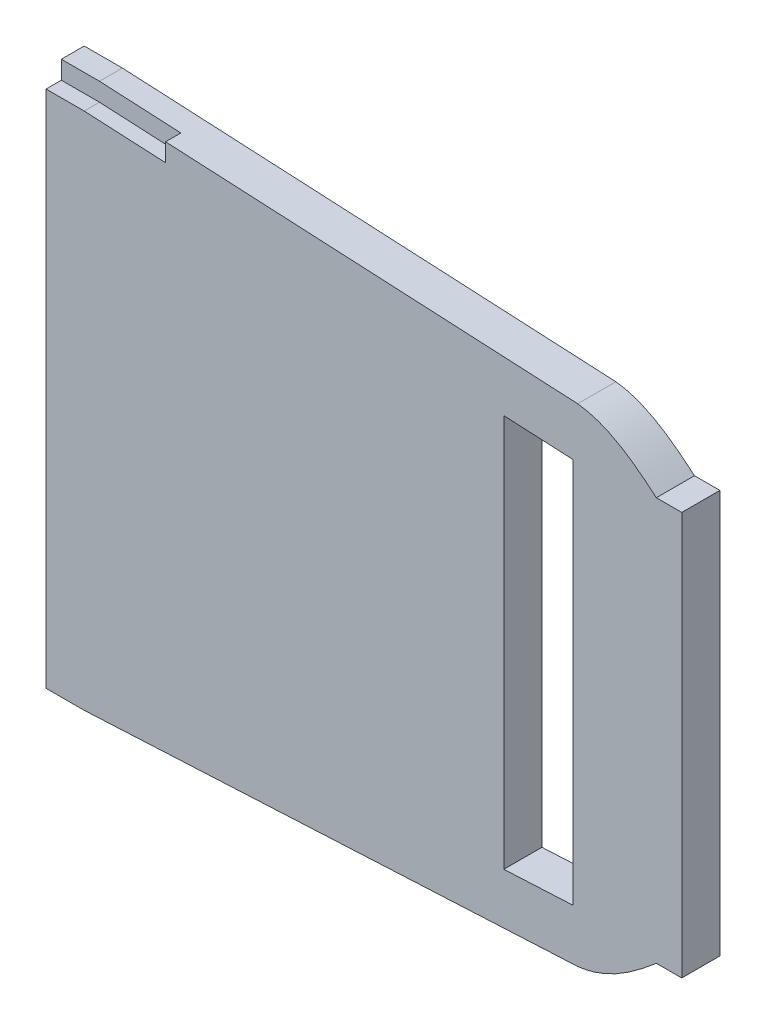
ISO-10303-21;
HEADER;
FILE_DESCRIPTION(('STEP AP214'),'2;1');
FILE_NAME('part.step','',(''),(''),'','','');
FILE_SCHEMA(('AUTOMOTIVE_DESIGN { 1 0 10303 214 1 1 1 1 }'));
ENDSEC;
DATA;
#1=APPLICATION_CONTEXT('core data for automotive mechanical design processes');
#2=APPLICATION_PROTOCOL_DEFINITION('international standard','automotive_design',2000,#1);
#3=PRODUCT_CONTEXT('',#1,'mechanical');
#4=PRODUCT('Part','Part','',(#3));
#5=PRODUCT_RELATED_PRODUCT_CATEGORY('part','',(#4));
#6=PRODUCT_DEFINITION_FORMATION('','',#4);
#7=PRODUCT_DEFINITION_CONTEXT('part definition',#1,'design');
#8=PRODUCT_DEFINITION('design','',#6,#7);
#9=PRODUCT_DEFINITION_SHAPE('','',#8);
#10=(LENGTH_UNIT() NAMED_UNIT(*) SI_UNIT(.MILLI.,.METRE.));
#11=(NAMED_UNIT(*) PLANE_ANGLE_UNIT() SI_UNIT($,.RADIAN.));
#12=(NAMED_UNIT(*) SI_UNIT($,.STERADIAN.) SOLID_ANGLE_UNIT());
#13=UNCERTAINTY_MEASURE_WITH_UNIT(LENGTH_MEASURE(1.E-05),#10,'distance_accuracy_value','');
#14=(GEOMETRIC_REPRESENTATION_CONTEXT(3) GLOBAL_UNCERTAINTY_ASSIGNED_CONTEXT((#13)) GLOBAL_UNIT_ASSIGNED_CONTEXT((#10,
#11,#12)) REPRESENTATION_CONTEXT('',''));
#15=CARTESIAN_POINT('',(0.,0.,0.));
#16=DIRECTION('',(0.,0.,1.));
#17=DIRECTION('',(1.,0.,0.));
#18=AXIS2_PLACEMENT_3D('',#15,#16,#17);
#19=CARTESIAN_POINT('',(113.496599029242,-53.9274721495546,7.5));
#20=CARTESIAN_POINT('',(114.973875685019,-53.7603476797445,7.5));
#21=CARTESIAN_POINT('',(116.389465073367,-53.4083030879014,7.5));
#22=CARTESIAN_POINT('',(118.438931287648,-52.6586523663147,7.5));
#23=CARTESIAN_POINT('',(119.109837198218,-52.372048443912,7.5));
#24=CARTESIAN_POINT('',(120.430638867593,-51.7358583988843,7.5));
#25=CARTESIAN_POINT('',(121.08291585581,-51.3847824339607,7.5));
#26=CARTESIAN_POINT('',(122.988929435586,-50.2674897114088,7.5));
#27=CARTESIAN_POINT('',(124.197203446337,-49.4371699813625,7.5));
#28=CARTESIAN_POINT('',(126.541735841739,-47.677906535742,7.5));
#29=CARTESIAN_POINT('',(127.677620036209,-46.7484503740677,7.5));
#30=CARTESIAN_POINT('',(128.850515141027,-45.748918780121,7.5));
#31=CARTESIAN_POINT('',(128.904828159406,-45.7025433508818,7.5));
#32=CARTESIAN_POINT('',(128.959100065767,-45.6561164922051,7.5));
#33=B_SPLINE_CURVE_WITH_KNOTS('',3,(#19,#20,#21,#22,#23,#24,#25,#26,#27,#28,#29,#30,#31,#32),
.UNSPECIFIED.,.F.,.F.,(4,2,2,2,2,2,4),(0.,0.125,0.1875,0.25,0.375,0.5,0.506074437752963),.UNSPECIFIED.);
#34=DIRECTION('',(0.,0.,-1.));
#35=VECTOR('',#34,1.);
#36=SURFACE_OF_LINEAR_EXTRUSION('',#33,#35);
#37=CARTESIAN_POINT('',(113.496599029242,-53.9274721495546,0.));
#38=CARTESIAN_POINT('',(114.973875685019,-53.7603476797445,0.));
#39=CARTESIAN_POINT('',(116.389465073367,-53.4083030879014,0.));
#40=CARTESIAN_POINT('',(118.438931287648,-52.6586523663147,0.));
#41=CARTESIAN_POINT('',(119.109837198218,-52.372048443912,0.));
#42=CARTESIAN_POINT('',(120.430638867593,-51.7358583988843,0.));
#43=CARTESIAN_POINT('',(121.08291585581,-51.3847824339607,0.));
#44=CARTESIAN_POINT('',(122.988929435586,-50.2674897114088,0.));
#45=CARTESIAN_POINT('',(124.197203446337,-49.4371699813625,0.));
#46=CARTESIAN_POINT('',(126.541735841739,-47.677906535742,0.));
#47=CARTESIAN_POINT('',(127.677620036209,-46.7484503740677,0.));
#48=CARTESIAN_POINT('',(128.850515141027,-45.748918780121,0.));
#49=CARTESIAN_POINT('',(128.904828159406,-45.7025433508818,0.));
#50=CARTESIAN_POINT('',(128.959100065767,-45.6561164922051,0.));
#51=B_SPLINE_CURVE_WITH_KNOTS('',3,(#37,#38,#39,#40,#41,#42,#43,#44,#45,#46,#47,#48,#49,#50),
.UNSPECIFIED.,.F.,.F.,(4,2,2,2,2,2,4),(0.,0.125,0.1875,0.25,0.375,0.5,0.506074437752963),.UNSPECIFIED.);
#52=CARTESIAN_POINT('',(113.496599029242,-53.9274721495546,0.));
#53=VERTEX_POINT('',#52);
#54=CARTESIAN_POINT('',(128.959100065767,-45.6561164922051,0.));
#55=VERTEX_POINT('',#54);
#56=EDGE_CURVE('E216',#53,#55,#51,.T.);
#57=ORIENTED_EDGE('',*,*,#56,.T.);
#58=DIRECTION('',(0.,0.,-1.));
#59=VECTOR('',#58,1.);
#60=CARTESIAN_POINT('',(128.959100065767,-45.6561164922051,7.5));
#61=LINE('',#60,#59);
#62=CARTESIAN_POINT('',(128.959100065767,-45.6561164922051,7.5));
#63=VERTEX_POINT('',#62);
#64=EDGE_CURVE('E225',#63,#55,#61,.T.);
#65=ORIENTED_EDGE('',*,*,#64,.F.);
#66=CARTESIAN_POINT('',(128.959100065767,-45.6561164922051,7.5));
#67=CARTESIAN_POINT('',(128.904828159406,-45.7025433508818,7.5));
#68=CARTESIAN_POINT('',(128.850515141027,-45.748918780121,7.5));
#69=CARTESIAN_POINT('',(127.677620036209,-46.7484503740677,7.5));
#70=CARTESIAN_POINT('',(126.541735841739,-47.677906535742,7.5));
#71=CARTESIAN_POINT('',(124.197203446337,-49.4371699813625,7.5));
#72=CARTESIAN_POINT('',(122.988929435586,-50.2674897114088,7.5));
#73=CARTESIAN_POINT('',(121.08291585581,-51.3847824339607,7.5));
#74=CARTESIAN_POINT('',(120.430638867593,-51.7358583988843,7.5));
#75=CARTESIAN_POINT('',(119.109837198218,-52.372048443912,7.5));
#76=CARTESIAN_POINT('',(118.438931287648,-52.6586523663147,7.5));
#77=CARTESIAN_POINT('',(116.389465073367,-53.4083030879014,7.5));
#78=CARTESIAN_POINT('',(114.973875685019,-53.7603476797445,7.5));
#79=CARTESIAN_POINT('',(113.496599029242,-53.9274721495546,7.5));
#80=B_SPLINE_CURVE_WITH_KNOTS('',3,(#66,#67,#68,#69,#70,#71,#72,#73,#74,#75,#76,#77,#78,#79),
.UNSPECIFIED.,.F.,.F.,(4,2,2,2,2,2,4),(0.,0.00607443775296213,0.131074437752962,
0.256074437752962,0.318574437752962,0.381074437752962,0.506074437752963),.UNSPECIFIED.);
#81=CARTESIAN_POINT('',(113.496599029242,-53.9274721495546,7.5));
#82=VERTEX_POINT('',#81);
#83=EDGE_CURVE('E222',#82,#63,#80,.F.);
#84=ORIENTED_EDGE('',*,*,#83,.F.);
#85=DIRECTION('',(0.,0.,-1.));
#86=VECTOR('',#85,1.);
#87=CARTESIAN_POINT('',(113.496599029242,-53.9274721495546,7.5));
#88=LINE('',#87,#86);
#89=EDGE_CURVE('E228',#82,#53,#88,.T.);
#90=ORIENTED_EDGE('',*,*,#89,.T.);
#91=EDGE_LOOP('',(#57,#65,#84,#90));
#92=FACE_BOUND('',#91,.T.);
#93=ADVANCED_FACE('F36',(#92),#36,.F.);
#94=CARTESIAN_POINT('',(133.959100065767,-45.6561164922051,7.5));
#95=DIRECTION('',(0.,1.,0.));
#96=DIRECTION('',(0.,0.,1.));
#97=AXIS2_PLACEMENT_3D('',#94,#95,#96);
#98=PLANE('',#97);
#99=DIRECTION('',(1.,0.,0.));
#100=VECTOR('',#99,1.);
#101=CARTESIAN_POINT('',(133.959100065767,-45.6561164922051,0.));
#102=LINE('',#101,#100);
#103=CARTESIAN_POINT('',(133.959100065767,-45.6561164922051,0.));
#104=VERTEX_POINT('',#103);
#105=EDGE_CURVE('E250',#55,#104,#102,.T.);
#106=ORIENTED_EDGE('',*,*,#105,.T.);
#107=DIRECTION('',(0.,0.,-1.));
#108=VECTOR('',#107,1.);
#109=CARTESIAN_POINT('',(133.959100065767,-45.6561164922051,7.5));
#110=LINE('',#109,#108);
#111=CARTESIAN_POINT('',(133.959100065767,-45.6561164922051,7.5));
#112=VERTEX_POINT('',#111);
#113=EDGE_CURVE('E227',#112,#104,#110,.T.);
#114=ORIENTED_EDGE('',*,*,#113,.F.);
#115=DIRECTION('',(1.,0.,0.));
#116=VECTOR('',#115,1.);
#117=CARTESIAN_POINT('',(133.959100065767,-45.6561164922051,7.5));
#118=LINE('',#117,#116);
#119=EDGE_CURVE('E174',#63,#112,#118,.T.);
#120=ORIENTED_EDGE('',*,*,#119,.F.);
#121=ORIENTED_EDGE('',*,*,#64,.T.);
#122=EDGE_LOOP('',(#106,#114,#120,#121));
#123=FACE_BOUND('',#122,.T.);
#124=ADVANCED_FACE('F189',(#123),#98,.F.);
#125=CARTESIAN_POINT('',(133.959100065767,33.6286249988365,7.5));
#126=DIRECTION('',(-1.,0.,0.));
#127=DIRECTION('',(0.,0.,1.));
#128=AXIS2_PLACEMENT_3D('',#125,#126,#127);
#129=PLANE('',#128);
#130=DIRECTION('',(0.,1.,0.));
#131=VECTOR('',#130,1.);
#132=CARTESIAN_POINT('',(133.959100065767,33.6286249988365,0.));
#133=LINE('',#132,#131);
#134=CARTESIAN_POINT('',(133.959100065767,33.6286249988365,0.));
#135=VERTEX_POINT('',#134);
#136=EDGE_CURVE('E167',#104,#135,#133,.T.);
#137=ORIENTED_EDGE('',*,*,#136,.T.);
#138=DIRECTION('',(0.,0.,-1.));
#139=VECTOR('',#138,1.);
#140=CARTESIAN_POINT('',(133.959100065767,33.6286249988365,7.5));
#141=LINE('',#140,#139);
#142=CARTESIAN_POINT('',(133.959100065767,33.6286249988365,7.5));
#143=VERTEX_POINT('',#142);
#144=EDGE_CURVE('E131',#143,#135,#141,.T.);
#145=ORIENTED_EDGE('',*,*,#144,.F.);
#146=DIRECTION('',(0.,1.,0.));
#147=VECTOR('',#146,1.);
#148=CARTESIAN_POINT('',(133.959100065767,33.6286249988365,7.5));
#149=LINE('',#148,#147);
#150=EDGE_CURVE('E137',#112,#143,#149,.T.);
#151=ORIENTED_EDGE('',*,*,#150,.F.);
#152=ORIENTED_EDGE('',*,*,#113,.T.);
#153=EDGE_LOOP('',(#137,#145,#151,#152));
#154=FACE_BOUND('',#153,.T.);
#155=ADVANCED_FACE('F396',(#154),#129,.F.);
#156=CARTESIAN_POINT('',(128.959100065767,33.6286249988365,7.5));
#157=DIRECTION('',(0.,-1.,0.));
#158=DIRECTION('',(1.,0.,0.));
#159=AXIS2_PLACEMENT_3D('',#156,#157,#158);
#160=PLANE('',#159);
#161=DIRECTION('',(-1.,0.,0.));
#162=VECTOR('',#161,1.);
#163=CARTESIAN_POINT('',(128.959100065767,33.6286249988365,0.));
#164=LINE('',#163,#162);
#165=CARTESIAN_POINT('',(128.959100065767,33.6286249988365,0.));
#166=VERTEX_POINT('',#165);
#167=EDGE_CURVE('E273',#135,#166,#164,.T.);
#168=ORIENTED_EDGE('',*,*,#167,.T.);
#169=DIRECTION('',(0.,0.,-1.));
#170=VECTOR('',#169,1.);
#171=CARTESIAN_POINT('',(128.959100065767,33.6286249988365,7.5));
#172=LINE('',#171,#170);
#173=CARTESIAN_POINT('',(128.959100065767,33.6286249988365,7.5));
#174=VERTEX_POINT('',#173);
#175=EDGE_CURVE('E126',#174,#166,#172,.T.);
#176=ORIENTED_EDGE('',*,*,#175,.F.);
#177=DIRECTION('',(-1.,0.,0.));
#178=VECTOR('',#177,1.);
#179=CARTESIAN_POINT('',(128.959100065767,33.6286249988365,7.5));
#180=LINE('',#179,#178);
#181=EDGE_CURVE('E134',#143,#174,#180,.T.);
#182=ORIENTED_EDGE('',*,*,#181,.F.);
#183=ORIENTED_EDGE('',*,*,#144,.T.);
#184=EDGE_LOOP('',(#168,#176,#182,#183));
#185=FACE_BOUND('',#184,.T.);
#186=ADVANCED_FACE('F156',(#185),#160,.F.);
#187=CARTESIAN_POINT('',(128.959100065767,33.6286249988365,7.5));
#188=CARTESIAN_POINT('',(128.913387153807,33.6677305854445,7.5));
#189=CARTESIAN_POINT('',(127.751192536381,34.6603867776478,7.5));
#190=CARTESIAN_POINT('',(126.568806099182,35.6290410882219,7.5));
#191=CARTESIAN_POINT('',(124.805320753888,36.953884088555,7.5));
#192=CARTESIAN_POINT('',(124.207009004084,37.3837862099245,7.5));
#193=CARTESIAN_POINT('',(122.99205254347,38.2061450456974,7.5));
#194=CARTESIAN_POINT('',(122.374602127533,38.5992515888815,7.5));
#195=CARTESIAN_POINT('',(120.48433317173,39.7098518813711,7.5));
#196=CARTESIAN_POINT('',(119.174169326343,40.3596636748386,7.5));
#197=CARTESIAN_POINT('',(117.093195418547,41.1246439768413,7.5));
#198=CARTESIAN_POINT('',(116.387101293958,41.3414820254252,7.5));
#199=CARTESIAN_POINT('',(114.957490186829,41.6872639254354,7.5));
#200=CARTESIAN_POINT('',(114.232477088293,41.816732683296,7.5));
#201=CARTESIAN_POINT('',(113.496599029254,41.8999826486839,7.5));
#202=B_SPLINE_CURVE_WITH_KNOTS('',3,(#187,#188,#189,#190,#191,#192,#193,#194,#195,#196,#197,
#198,#199,#200,#201),.UNSPECIFIED.,.F.,.F.,(4,1,2,2,2,2,2,4),(0.494878568915185,
0.500000000000001,0.625000000000001,0.6875,0.75,0.875,0.9375,1.),.UNSPECIFIED.);
#203=DIRECTION('',(0.,0.,-1.));
#204=VECTOR('',#203,1.);
#205=SURFACE_OF_LINEAR_EXTRUSION('',#202,#204);
#206=CARTESIAN_POINT('',(128.959100065767,33.6286249988365,0.));
#207=CARTESIAN_POINT('',(128.913387153807,33.6677305854445,0.));
#208=CARTESIAN_POINT('',(127.751192536381,34.6603867776478,0.));
#209=CARTESIAN_POINT('',(126.568806099182,35.6290410882219,0.));
#210=CARTESIAN_POINT('',(124.805320753888,36.953884088555,0.));
#211=CARTESIAN_POINT('',(124.207009004084,37.3837862099245,0.));
#212=CARTESIAN_POINT('',(122.99205254347,38.2061450456974,0.));
#213=CARTESIAN_POINT('',(122.374602127533,38.5992515888815,0.));
#214=CARTESIAN_POINT('',(120.48433317173,39.7098518813711,0.));
#215=CARTESIAN_POINT('',(119.174169326343,40.3596636748386,0.));
#216=CARTESIAN_POINT('',(117.093195418547,41.1246439768413,0.));
#217=CARTESIAN_POINT('',(116.387101293958,41.3414820254252,0.));
#218=CARTESIAN_POINT('',(114.957490186829,41.6872639254354,0.));
#219=CARTESIAN_POINT('',(114.232477088293,41.816732683296,0.));
#220=CARTESIAN_POINT('',(113.496599029254,41.8999826486839,0.));
#221=B_SPLINE_CURVE_WITH_KNOTS('',3,(#206,#207,#208,#209,#210,#211,#212,#213,#214,#215,#216,
#217,#218,#219,#220),.UNSPECIFIED.,.F.,.F.,(4,1,2,2,2,2,2,4),(0.494878568915185,
0.500000000000001,0.625000000000001,0.6875,0.75,0.875,0.9375,1.),.UNSPECIFIED.);
#222=CARTESIAN_POINT('',(113.496599029254,41.8999826486839,0.));
#223=VERTEX_POINT('',#222);
#224=EDGE_CURVE('E285',#166,#223,#221,.T.);
#225=ORIENTED_EDGE('',*,*,#224,.T.);
#226=DIRECTION('',(0.,0.,-1.));
#227=VECTOR('',#226,1.);
#228=CARTESIAN_POINT('',(113.496599029254,41.8999826486839,7.5));
#229=LINE('',#228,#227);
#230=CARTESIAN_POINT('',(113.496599029254,41.8999826486839,7.5));
#231=VERTEX_POINT('',#230);
#232=EDGE_CURVE('E119',#231,#223,#229,.T.);
#233=ORIENTED_EDGE('',*,*,#232,.F.);
#234=CARTESIAN_POINT('',(113.496599029254,41.8999826486839,7.5));
#235=CARTESIAN_POINT('',(114.232477088293,41.816732683296,7.5));
#236=CARTESIAN_POINT('',(114.957490186829,41.6872639254354,7.5));
#237=CARTESIAN_POINT('',(116.387101293958,41.3414820254252,7.5));
#238=CARTESIAN_POINT('',(117.093195418547,41.1246439768413,7.5));
#239=CARTESIAN_POINT('',(119.174169326343,40.3596636748386,7.5));
#240=CARTESIAN_POINT('',(120.48433317173,39.7098518813711,7.5));
#241=CARTESIAN_POINT('',(122.374602127533,38.5992515888815,7.5));
#242=CARTESIAN_POINT('',(122.99205254347,38.2061450456974,7.5));
#243=CARTESIAN_POINT('',(124.207009004084,37.3837862099245,7.5));
#244=CARTESIAN_POINT('',(124.805320753888,36.953884088555,7.5));
#245=CARTESIAN_POINT('',(126.568806099182,35.6290410882219,7.5));
#246=CARTESIAN_POINT('',(127.751192536381,34.6603867776478,7.5));
#247=CARTESIAN_POINT('',(128.913387153807,33.6677305854445,7.5));
#248=CARTESIAN_POINT('',(128.959100065767,33.6286249988365,7.5));
#249=B_SPLINE_CURVE_WITH_KNOTS('',3,(#234,#235,#236,#237,#238,#239,#240,#241,#242,#243,#244,
#245,#246,#247,#248),.UNSPECIFIED.,.F.,.F.,(4,2,2,2,2,2,1,4),(0.494878568915185,
0.557378568915185,0.619878568915185,0.744878568915184,0.807378568915184,0.869878568915184,
0.994878568915184,1.),.UNSPECIFIED.);
#250=EDGE_CURVE('E118',#174,#231,#249,.F.);
#251=ORIENTED_EDGE('',*,*,#250,.F.);
#252=ORIENTED_EDGE('',*,*,#175,.T.);
#253=EDGE_LOOP('',(#225,#233,#251,#252));
#254=FACE_BOUND('',#253,.T.);
#255=ADVANCED_FACE('F144',(#254),#205,.F.);
#256=CARTESIAN_POINT('',(-87.7868041786044,42.6350691720137,7.5));
#257=DIRECTION('',(0.,0.,-1.));
#258=DIRECTION('',(-1.,0.,0.));
#259=AXIS2_PLACEMENT_3D('',#256,#257,#258);
#260=PLANE('',#259);
#261=DIRECTION('',(0.,-1.,0.));
#262=VECTOR('',#261,1.);
#263=CARTESIAN_POINT('',(98.9591000657665,32.6219937575387,7.5));
#264=LINE('',#263,#262);
#265=CARTESIAN_POINT('',(98.9591000657665,32.6219937575387,7.5));
#266=VERTEX_POINT('',#265);
#267=CARTESIAN_POINT('',(98.9591000657665,-44.6494832584097,7.5));
#268=VERTEX_POINT('',#267);
#269=EDGE_CURVE('E360',#266,#268,#264,.T.);
#270=ORIENTED_EDGE('',*,*,#269,.F.);
#271=DIRECTION('',(-0.998725119042124,0.0504790708541182,0.));
#272=VECTOR('',#271,1.);
#273=CARTESIAN_POINT('',(112.616329260754,31.9317094870621,7.5));
#274=LINE('',#273,#272);
#275=CARTESIAN_POINT('',(112.616329260754,31.9317094870621,7.5));
#276=VERTEX_POINT('',#275);
#277=EDGE_CURVE('E365',#276,#266,#274,.T.);
#278=ORIENTED_EDGE('',*,*,#277,.F.);
#279=DIRECTION('',(4.17239632132886E-06,0.999999999991296,0.));
#280=VECTOR('',#279,1.);
#281=CARTESIAN_POINT('',(112.616329260754,31.9317094870621,7.5));
#282=LINE('',#281,#280);
#283=CARTESIAN_POINT('',(112.61601261374,-43.959214992383,7.5));
#284=VERTEX_POINT('',#283);
#285=EDGE_CURVE('E368',#284,#276,#282,.T.);
#286=ORIENTED_EDGE('',*,*,#285,.F.);
#287=DIRECTION('',(0.998725119042121,0.0504790708541747,0.));
#288=VECTOR('',#287,1.);
#289=CARTESIAN_POINT('',(98.9591000657665,-44.6494832584097,7.5));
#290=LINE('',#289,#288);
#291=EDGE_CURVE('E354',#268,#284,#290,.T.);
#292=ORIENTED_EDGE('',*,*,#291,.F.);
#293=EDGE_LOOP('',(#270,#278,#286,#292));
#294=FACE_BOUND('',#293,.T.);
#295=DIRECTION('',(0.998725119042124,-0.0504790708541182,0.));
#296=VECTOR('',#295,1.);
#297=CARTESIAN_POINT('',(0.459100065754559,44.0380832453436,7.5));
#298=LINE('',#297,#296);
#299=CARTESIAN_POINT('',(16.4591000657546,43.2293871203873,7.5));
#300=VERTEX_POINT('',#299);
#301=CARTESIAN_POINT('',(32.4591000657546,42.420690995431,7.5));
#302=VERTEX_POINT('',#301);
#303=EDGE_CURVE('E11',#300,#302,#298,.T.);
#304=ORIENTED_EDGE('',*,*,#303,.F.);
#305=DIRECTION('',(1.,0.,0.));
#306=VECTOR('',#305,1.);
#307=CARTESIAN_POINT('',(8.95910006575456,43.2293871203873,7.5));
#308=LINE('',#307,#306);
#309=CARTESIAN_POINT('',(8.95910006575456,43.2293871203873,7.5));
#310=VERTEX_POINT('',#309);
#311=EDGE_CURVE('E511',#310,#300,#308,.T.);
#312=ORIENTED_EDGE('',*,*,#311,.F.);
#313=DIRECTION('',(0.,1.,0.));
#314=VECTOR('',#313,1.);
#315=CARTESIAN_POINT('',(8.95910006575456,-58.8320877362616,7.5));
#316=LINE('',#315,#314);
#317=CARTESIAN_POINT('',(8.95910006575456,-58.8320877362616,7.5));
#318=VERTEX_POINT('',#317);
#319=EDGE_CURVE('E501',#318,#310,#316,.T.);
#320=ORIENTED_EDGE('',*,*,#319,.F.);
#321=DIRECTION('',(1.,0.,0.));
#322=VECTOR('',#321,1.);
#323=CARTESIAN_POINT('',(8.95910006575456,-58.8320877362616,7.5));
#324=LINE('',#323,#322);
#325=CARTESIAN_POINT('',(16.4591000657546,-58.8320877362616,7.5));
#326=VERTEX_POINT('',#325);
#327=EDGE_CURVE('E514',#318,#326,#324,.T.);
#328=ORIENTED_EDGE('',*,*,#327,.T.);
#329=DIRECTION('',(0.998725119042121,0.0504790708541748,0.));
#330=VECTOR('',#329,1.);
#331=CARTESIAN_POINT('',(-75.9633453556009,-63.5034423282191,7.5));
#332=LINE('',#331,#330);
#333=EDGE_CURVE('E303',#326,#82,#332,.T.);
#334=ORIENTED_EDGE('',*,*,#333,.T.);
#335=ORIENTED_EDGE('',*,*,#83,.T.);
#336=ORIENTED_EDGE('',*,*,#119,.T.);
#337=ORIENTED_EDGE('',*,*,#150,.T.);
#338=ORIENTED_EDGE('',*,*,#181,.T.);
#339=ORIENTED_EDGE('',*,*,#250,.T.);
#340=DIRECTION('',(-0.998725119042124,0.0504790708541185,0.));
#341=VECTOR('',#340,1.);
#342=CARTESIAN_POINT('',(113.496599029254,41.8999826486839,7.5));
#343=LINE('',#342,#341);
#344=CARTESIAN_POINT('',(32.4591000657546,45.9959021104297,7.5));
#345=VERTEX_POINT('',#344);
#346=EDGE_CURVE('E114',#231,#345,#343,.T.);
#347=ORIENTED_EDGE('',*,*,#346,.T.);
#348=DIRECTION('',(0.,1.,0.));
#349=VECTOR('',#348,1.);
#350=CARTESIAN_POINT('',(32.4591000657546,42.420690995431,7.5));
#351=LINE('',#350,#349);
#352=EDGE_CURVE('E45',#302,#345,#351,.T.);
#353=ORIENTED_EDGE('',*,*,#352,.F.);
#354=EDGE_LOOP('',(#304,#312,#320,#328,#334,#335,#336,#337,#338,#339,#347,#353));
#355=FACE_BOUND('',#354,.T.);
#356=ADVANCED_FACE('F155',(#294,#355),#260,.F.);
#357=CARTESIAN_POINT('',(32.4591000657546,42.420690995431,4.5));
#358=DIRECTION('',(1.,0.,0.));
#359=DIRECTION('',(0.,0.,-1.));
#360=AXIS2_PLACEMENT_3D('',#357,#358,#359);
#361=PLANE('',#360);
#362=ORIENTED_EDGE('',*,*,#352,.T.);
#363=DIRECTION('',(0.,0.,1.));
#364=VECTOR('',#363,1.);
#365=CARTESIAN_POINT('',(32.4591000657546,45.9959021104297,4.5));
#366=LINE('',#365,#364);
#367=CARTESIAN_POINT('',(32.4591000657546,45.9959021104297,4.5));
#368=VERTEX_POINT('',#367);
#369=EDGE_CURVE('E90',#368,#345,#366,.T.);
#370=ORIENTED_EDGE('',*,*,#369,.F.);
#371=DIRECTION('',(0.,1.,0.));
#372=VECTOR('',#371,1.);
#373=CARTESIAN_POINT('',(32.4591000657546,42.420690995431,4.5));
#374=LINE('',#373,#372);
#375=CARTESIAN_POINT('',(32.4591000657546,42.420690995431,4.5));
#376=VERTEX_POINT('',#375);
#377=EDGE_CURVE('E78',#376,#368,#374,.T.);
#378=ORIENTED_EDGE('',*,*,#377,.F.);
#379=DIRECTION('',(0.,0.,1.));
#380=VECTOR('',#379,1.);
#381=CARTESIAN_POINT('',(32.4591000657546,42.420690995431,4.5));
#382=LINE('',#381,#380);
#383=EDGE_CURVE('E85',#376,#302,#382,.T.);
#384=ORIENTED_EDGE('',*,*,#383,.T.);
#385=EDGE_LOOP('',(#362,#370,#378,#384));
#386=FACE_BOUND('',#385,.T.);
#387=ADVANCED_FACE('F93',(#386),#361,.F.);
#388=CARTESIAN_POINT('',(0.459100065754559,44.0380832453436,4.5));
#389=DIRECTION('',(-0.0504790708541182,-0.998725119042124,0.));
#390=DIRECTION('',(0.998725119042124,-0.0504790708541182,0.));
#391=AXIS2_PLACEMENT_3D('',#388,#389,#390);
#392=PLANE('',#391);
#393=DIRECTION('',(0.,0.,-1.));
#394=VECTOR('',#393,1.);
#395=CARTESIAN_POINT('',(16.4591000657546,43.2293871203873,4.5));
#396=LINE('',#395,#394);
#397=CARTESIAN_POINT('',(16.4591000657546,43.2293871203873,4.5));
#398=VERTEX_POINT('',#397);
#399=EDGE_CURVE('E107',#300,#398,#396,.T.);
#400=ORIENTED_EDGE('',*,*,#399,.F.);
#401=ORIENTED_EDGE('',*,*,#303,.T.);
#402=ORIENTED_EDGE('',*,*,#383,.F.);
#403=DIRECTION('',(0.998725119042124,-0.0504790708541182,0.));
#404=VECTOR('',#403,1.);
#405=CARTESIAN_POINT('',(0.459100065754559,44.0380832453436,4.5));
#406=LINE('',#405,#404);
#407=EDGE_CURVE('E75',#398,#376,#406,.T.);
#408=ORIENTED_EDGE('',*,*,#407,.F.);
#409=EDGE_LOOP('',(#400,#401,#402,#408));
#410=FACE_BOUND('',#409,.T.);
#411=ADVANCED_FACE('F86',(#410),#392,.F.);
#412=CARTESIAN_POINT('',(113.496599029254,41.8999826486839,7.5));
#413=DIRECTION('',(-0.0504790708541185,-0.998725119042124,0.));
#414=DIRECTION('',(0.998725119042124,-0.0504790708541185,0.));
#415=AXIS2_PLACEMENT_3D('',#412,#413,#414);
#416=PLANE('',#415);
#417=DIRECTION('',(0.,0.,-1.));
#418=VECTOR('',#417,1.);
#419=CARTESIAN_POINT('',(16.4591000657546,46.804598235386,7.5));
#420=LINE('',#419,#418);
#421=CARTESIAN_POINT('',(16.4591000657546,46.804598235386,4.5));
#422=VERTEX_POINT('',#421);
#423=CARTESIAN_POINT('',(16.4591000657546,46.804598235386,0.));
#424=VERTEX_POINT('',#423);
#425=EDGE_CURVE('E104',#422,#424,#420,.T.);
#426=ORIENTED_EDGE('',*,*,#425,.F.);
#427=DIRECTION('',(0.998725119042124,-0.0504790708541185,0.));
#428=VECTOR('',#427,1.);
#429=CARTESIAN_POINT('',(0.459100065754559,47.6132943603423,4.5));
#430=LINE('',#429,#428);
#431=EDGE_CURVE('E89',#422,#368,#430,.T.);
#432=ORIENTED_EDGE('',*,*,#431,.T.);
#433=ORIENTED_EDGE('',*,*,#369,.T.);
#434=ORIENTED_EDGE('',*,*,#346,.F.);
#435=ORIENTED_EDGE('',*,*,#232,.T.);
#436=DIRECTION('',(-0.998725119042124,0.0504790708541185,0.));
#437=VECTOR('',#436,1.);
#438=CARTESIAN_POINT('',(113.496599029254,41.8999826486839,0.));
#439=LINE('',#438,#437);
#440=EDGE_CURVE('E300',#223,#424,#439,.T.);
#441=ORIENTED_EDGE('',*,*,#440,.T.);
#442=EDGE_LOOP('',(#426,#432,#433,#434,#435,#441));
#443=FACE_BOUND('',#442,.T.);
#444=ADVANCED_FACE('F375',(#443),#416,.F.);
#445=CARTESIAN_POINT('',(0.,0.,4.5));
#446=DIRECTION('',(0.,0.,1.));
#447=DIRECTION('',(1.,0.,0.));
#448=AXIS2_PLACEMENT_3D('',#445,#446,#447);
#449=PLANE('',#448);
#450=ORIENTED_EDGE('',*,*,#431,.F.);
#451=DIRECTION('',(1.,0.,0.));
#452=VECTOR('',#451,1.);
#453=CARTESIAN_POINT('',(8.95910006575456,46.804598235386,4.5));
#454=LINE('',#453,#452);
#455=CARTESIAN_POINT('',(8.95910006575456,46.804598235386,4.5));
#456=VERTEX_POINT('',#455);
#457=EDGE_CURVE('E507',#456,#422,#454,.T.);
#458=ORIENTED_EDGE('',*,*,#457,.F.);
#459=DIRECTION('',(0.,1.,0.));
#460=VECTOR('',#459,1.);
#461=CARTESIAN_POINT('',(8.95910006575456,43.2293871203873,4.5));
#462=LINE('',#461,#460);
#463=CARTESIAN_POINT('',(8.95910006575456,43.2293871203873,4.5));
#464=VERTEX_POINT('',#463);
#465=EDGE_CURVE('E505',#464,#456,#462,.T.);
#466=ORIENTED_EDGE('',*,*,#465,.F.);
#467=DIRECTION('',(1.,0.,0.));
#468=VECTOR('',#467,1.);
#469=CARTESIAN_POINT('',(8.95910006575456,43.2293871203873,4.5));
#470=LINE('',#469,#468);
#471=EDGE_CURVE('E82',#464,#398,#470,.T.);
#472=ORIENTED_EDGE('',*,*,#471,.T.);
#473=ORIENTED_EDGE('',*,*,#407,.T.);
#474=ORIENTED_EDGE('',*,*,#377,.T.);
#475=EDGE_LOOP('',(#450,#458,#466,#472,#473,#474));
#476=FACE_BOUND('',#475,.T.);
#477=ADVANCED_FACE('F38',(#476),#449,.T.);
#478=CARTESIAN_POINT('',(-75.9633453556009,-63.5034423282191,7.5));
#479=DIRECTION('',(-0.0504790708541748,0.998725119042121,0.));
#480=DIRECTION('',(-0.998725119042121,-0.0504790708541748,0.));
#481=AXIS2_PLACEMENT_3D('',#478,#479,#480);
#482=PLANE('',#481);
#483=DIRECTION('',(0.,0.,1.));
#484=VECTOR('',#483,1.);
#485=CARTESIAN_POINT('',(16.4591000657546,-58.8320877362616,7.5));
#486=LINE('',#485,#484);
#487=CARTESIAN_POINT('',(16.4591000657546,-58.8320877362616,0.));
#488=VERTEX_POINT('',#487);
#489=EDGE_CURVE('E100',#488,#326,#486,.T.);
#490=ORIENTED_EDGE('',*,*,#489,.F.);
#491=DIRECTION('',(0.998725119042121,0.0504790708541748,0.));
#492=VECTOR('',#491,1.);
#493=CARTESIAN_POINT('',(-75.9633453556009,-63.5034423282191,0.));
#494=LINE('',#493,#492);
#495=EDGE_CURVE('E520',#488,#53,#494,.T.);
#496=ORIENTED_EDGE('',*,*,#495,.T.);
#497=ORIENTED_EDGE('',*,*,#89,.F.);
#498=ORIENTED_EDGE('',*,*,#333,.F.);
#499=EDGE_LOOP('',(#490,#496,#497,#498));
#500=FACE_BOUND('',#499,.T.);
#501=ADVANCED_FACE('F541',(#500),#482,.F.);
#502=CARTESIAN_POINT('',(112.616329260754,31.9317094870621,-0.00999999999999959));
#503=DIRECTION('',(0.999999999991296,-4.17239632132886E-06,0.));
#504=DIRECTION('',(4.17239632132886E-06,0.999999999991296,0.));
#505=AXIS2_PLACEMENT_3D('',#502,#503,#504);
#506=PLANE('',#505);
#507=DIRECTION('',(-4.17239632132886E-06,-0.999999999991296,0.));
#508=VECTOR('',#507,1.);
#509=CARTESIAN_POINT('',(112.616373915924,42.6342330105306,0.));
#510=LINE('',#509,#508);
#511=CARTESIAN_POINT('',(112.616329260754,31.9317094870621,0.));
#512=VERTEX_POINT('',#511);
#513=CARTESIAN_POINT('',(112.61601261374,-43.959214992383,0.));
#514=VERTEX_POINT('',#513);
#515=EDGE_CURVE('E244',#512,#514,#510,.T.);
#516=ORIENTED_EDGE('',*,*,#515,.T.);
#517=DIRECTION('',(0.,0.,1.));
#518=VECTOR('',#517,1.);
#519=CARTESIAN_POINT('',(112.61601261374,-43.959214992383,-0.00999999999999959));
#520=LINE('',#519,#518);
#521=EDGE_CURVE('E358',#514,#284,#520,.T.);
#522=ORIENTED_EDGE('',*,*,#521,.T.);
#523=ORIENTED_EDGE('',*,*,#285,.T.);
#524=DIRECTION('',(0.,0.,1.));
#525=VECTOR('',#524,1.);
#526=CARTESIAN_POINT('',(112.616329260754,31.9317094870621,-0.00999999999999959));
#527=LINE('',#526,#525);
#528=EDGE_CURVE('E522',#512,#276,#527,.T.);
#529=ORIENTED_EDGE('',*,*,#528,.F.);
#530=EDGE_LOOP('',(#516,#522,#523,#529));
#531=FACE_BOUND('',#530,.T.);
#532=ADVANCED_FACE('F526',(#531),#506,.F.);
#533=CARTESIAN_POINT('',(98.9591000657665,-44.6494832584097,-0.00999999999999959));
#534=DIRECTION('',(0.0504790708541747,-0.998725119042121,0.));
#535=DIRECTION('',(0.998725119042121,0.0504790708541747,0.));
#536=AXIS2_PLACEMENT_3D('',#533,#534,#535);
#537=PLANE('',#536);
#538=DIRECTION('',(-0.998725119042121,-0.0504790708541747,0.));
#539=VECTOR('',#538,1.);
#540=CARTESIAN_POINT('',(-82.9105241800094,-53.8418120318461,0.));
#541=LINE('',#540,#539);
#542=CARTESIAN_POINT('',(98.9591000657665,-44.6494832584097,0.));
#543=VERTEX_POINT('',#542);
#544=EDGE_CURVE('E235',#514,#543,#541,.T.);
#545=ORIENTED_EDGE('',*,*,#544,.T.);
#546=DIRECTION('',(0.,0.,1.));
#547=VECTOR('',#546,1.);
#548=CARTESIAN_POINT('',(98.9591000657665,-44.6494832584097,-0.00999999999999959));
#549=LINE('',#548,#547);
#550=EDGE_CURVE('E349',#543,#268,#549,.T.);
#551=ORIENTED_EDGE('',*,*,#550,.T.);
#552=ORIENTED_EDGE('',*,*,#291,.T.);
#553=ORIENTED_EDGE('',*,*,#521,.F.);
#554=EDGE_LOOP('',(#545,#551,#552,#553));
#555=FACE_BOUND('',#554,.T.);
#556=ADVANCED_FACE('F351',(#555),#537,.F.);
#557=CARTESIAN_POINT('',(98.9591000657665,32.6219937575387,-0.00999999999999959));
#558=DIRECTION('',(-1.,0.,0.));
#559=DIRECTION('',(0.,0.,1.));
#560=AXIS2_PLACEMENT_3D('',#557,#558,#559);
#561=PLANE('',#560);
#562=DIRECTION('',(0.,1.,0.));
#563=VECTOR('',#562,1.);
#564=CARTESIAN_POINT('',(98.9591000657665,42.6350691720137,0.));
#565=LINE('',#564,#563);
#566=CARTESIAN_POINT('',(98.9591000657665,32.6219937575387,0.));
#567=VERTEX_POINT('',#566);
#568=EDGE_CURVE('E230',#543,#567,#565,.T.);
#569=ORIENTED_EDGE('',*,*,#568,.T.);
#570=DIRECTION('',(0.,0.,1.));
#571=VECTOR('',#570,1.);
#572=CARTESIAN_POINT('',(98.9591000657665,32.6219937575387,-0.00999999999999959));
#573=LINE('',#572,#571);
#574=EDGE_CURVE('E179',#567,#266,#573,.T.);
#575=ORIENTED_EDGE('',*,*,#574,.T.);
#576=ORIENTED_EDGE('',*,*,#269,.T.);
#577=ORIENTED_EDGE('',*,*,#550,.F.);
#578=EDGE_LOOP('',(#569,#575,#576,#577));
#579=FACE_BOUND('',#578,.T.);
#580=ADVANCED_FACE('F361',(#579),#561,.F.);
#581=CARTESIAN_POINT('',(112.616329260754,31.9317094870621,-0.00999999999999959));
#582=DIRECTION('',(0.0504790708541182,0.998725119042124,0.));
#583=DIRECTION('',(-0.998725119042124,0.0504790708541182,0.));
#584=AXIS2_PLACEMENT_3D('',#581,#582,#583);
#585=PLANE('',#584);
#586=DIRECTION('',(0.998725119042124,-0.0504790708541182,0.));
#587=VECTOR('',#586,1.);
#588=CARTESIAN_POINT('',(-87.8157564599517,42.0622501770149,0.));
#589=LINE('',#588,#587);
#590=EDGE_CURVE('E103',#567,#512,#589,.T.);
#591=ORIENTED_EDGE('',*,*,#590,.T.);
#592=ORIENTED_EDGE('',*,*,#528,.T.);
#593=ORIENTED_EDGE('',*,*,#277,.T.);
#594=ORIENTED_EDGE('',*,*,#574,.F.);
#595=EDGE_LOOP('',(#591,#592,#593,#594));
#596=FACE_BOUND('',#595,.T.);
#597=ADVANCED_FACE('F159',(#596),#585,.F.);
#598=CARTESIAN_POINT('',(-87.7868041786044,42.6350691720137,0.));
#599=DIRECTION('',(0.,0.,-1.));
#600=DIRECTION('',(-1.,0.,0.));
#601=AXIS2_PLACEMENT_3D('',#598,#599,#600);
#602=PLANE('',#601);
#603=ORIENTED_EDGE('',*,*,#590,.F.);
#604=ORIENTED_EDGE('',*,*,#568,.F.);
#605=ORIENTED_EDGE('',*,*,#544,.F.);
#606=ORIENTED_EDGE('',*,*,#515,.F.);
#607=EDGE_LOOP('',(#603,#604,#605,#606));
#608=FACE_BOUND('',#607,.T.);
#609=ORIENTED_EDGE('',*,*,#495,.F.);
#610=DIRECTION('',(1.,0.,0.));
#611=VECTOR('',#610,1.);
#612=CARTESIAN_POINT('',(8.95910006575456,-58.8320877362616,0.));
#613=LINE('',#612,#611);
#614=CARTESIAN_POINT('',(8.95910006575456,-58.8320877362616,0.));
#615=VERTEX_POINT('',#614);
#616=EDGE_CURVE('E516',#615,#488,#613,.T.);
#617=ORIENTED_EDGE('',*,*,#616,.F.);
#618=DIRECTION('',(0.,-1.,0.));
#619=VECTOR('',#618,1.);
#620=CARTESIAN_POINT('',(8.95910006575456,46.804598235386,0.));
#621=LINE('',#620,#619);
#622=CARTESIAN_POINT('',(8.95910006575456,46.804598235386,0.));
#623=VERTEX_POINT('',#622);
#624=EDGE_CURVE('E497',#623,#615,#621,.T.);
#625=ORIENTED_EDGE('',*,*,#624,.F.);
#626=DIRECTION('',(1.,0.,0.));
#627=VECTOR('',#626,1.);
#628=CARTESIAN_POINT('',(8.95910006575456,46.804598235386,0.));
#629=LINE('',#628,#627);
#630=EDGE_CURVE('E108',#623,#424,#629,.T.);
#631=ORIENTED_EDGE('',*,*,#630,.T.);
#632=ORIENTED_EDGE('',*,*,#440,.F.);
#633=ORIENTED_EDGE('',*,*,#224,.F.);
#634=ORIENTED_EDGE('',*,*,#167,.F.);
#635=ORIENTED_EDGE('',*,*,#136,.F.);
#636=ORIENTED_EDGE('',*,*,#105,.F.);
#637=ORIENTED_EDGE('',*,*,#56,.F.);
#638=EDGE_LOOP('',(#609,#617,#625,#631,#632,#633,#634,#635,#636,#637));
#639=FACE_BOUND('',#638,.T.);
#640=ADVANCED_FACE('F255',(#608,#639),#602,.T.);
#641=CARTESIAN_POINT('',(8.95910006575456,46.804598235386,4.5));
#642=DIRECTION('',(0.,-1.,0.));
#643=DIRECTION('',(0.,0.,-1.));
#644=AXIS2_PLACEMENT_3D('',#641,#642,#643);
#645=PLANE('',#644);
#646=ORIENTED_EDGE('',*,*,#425,.T.);
#647=ORIENTED_EDGE('',*,*,#630,.F.);
#648=DIRECTION('',(0.,0.,-1.));
#649=VECTOR('',#648,1.);
#650=CARTESIAN_POINT('',(8.95910006575456,46.804598235386,4.5));
#651=LINE('',#650,#649);
#652=EDGE_CURVE('E491',#456,#623,#651,.T.);
#653=ORIENTED_EDGE('',*,*,#652,.F.);
#654=ORIENTED_EDGE('',*,*,#457,.T.);
#655=EDGE_LOOP('',(#646,#647,#653,#654));
#656=FACE_BOUND('',#655,.T.);
#657=ADVANCED_FACE('F191',(#656),#645,.F.);
#658=CARTESIAN_POINT('',(8.95910006575456,-58.8320877362616,0.));
#659=DIRECTION('',(0.,1.,0.));
#660=DIRECTION('',(0.,0.,1.));
#661=AXIS2_PLACEMENT_3D('',#658,#659,#660);
#662=PLANE('',#661);
#663=ORIENTED_EDGE('',*,*,#489,.T.);
#664=ORIENTED_EDGE('',*,*,#327,.F.);
#665=DIRECTION('',(0.,0.,1.));
#666=VECTOR('',#665,1.);
#667=CARTESIAN_POINT('',(8.95910006575456,-58.8320877362616,0.));
#668=LINE('',#667,#666);
#669=EDGE_CURVE('E499',#615,#318,#668,.T.);
#670=ORIENTED_EDGE('',*,*,#669,.F.);
#671=ORIENTED_EDGE('',*,*,#616,.T.);
#672=EDGE_LOOP('',(#663,#664,#670,#671));
#673=FACE_BOUND('',#672,.T.);
#674=ADVANCED_FACE('F655',(#673),#662,.F.);
#675=CARTESIAN_POINT('',(8.95910006575456,43.2293871203873,7.5));
#676=DIRECTION('',(0.,-1.,0.));
#677=DIRECTION('',(0.,0.,-1.));
#678=AXIS2_PLACEMENT_3D('',#675,#676,#677);
#679=PLANE('',#678);
#680=ORIENTED_EDGE('',*,*,#399,.T.);
#681=ORIENTED_EDGE('',*,*,#471,.F.);
#682=DIRECTION('',(0.,0.,-1.));
#683=VECTOR('',#682,1.);
#684=CARTESIAN_POINT('',(8.95910006575456,43.2293871203873,7.5));
#685=LINE('',#684,#683);
#686=EDGE_CURVE('E503',#310,#464,#685,.T.);
#687=ORIENTED_EDGE('',*,*,#686,.F.);
#688=ORIENTED_EDGE('',*,*,#311,.T.);
#689=EDGE_LOOP('',(#680,#681,#687,#688));
#690=FACE_BOUND('',#689,.T.);
#691=ADVANCED_FACE('F663',(#690),#679,.F.);
#692=CARTESIAN_POINT('',(8.95910006575456,0.,0.));
#693=DIRECTION('',(-1.,0.,0.));
#694=DIRECTION('',(0.,0.,1.));
#695=AXIS2_PLACEMENT_3D('',#692,#693,#694);
#696=PLANE('',#695);
#697=DIRECTION('',(0.,-1.,0.));
#698=VECTOR('',#697,1.);
#699=CARTESIAN_POINT('',(8.95910006575456,41.4293871203873,1.8));
#700=LINE('',#699,#698);
#701=CARTESIAN_POINT('',(8.95910006575456,41.4293871203873,1.8));
#702=VERTEX_POINT('',#701);
#703=CARTESIAN_POINT('',(8.95910006575456,-57.0320877362616,1.8));
#704=VERTEX_POINT('',#703);
#705=EDGE_CURVE('E53',#702,#704,#700,.T.);
#706=ORIENTED_EDGE('',*,*,#705,.F.);
#707=DIRECTION('',(0.,0.,-1.));
#708=VECTOR('',#707,1.);
#709=CARTESIAN_POINT('',(8.95910006575456,41.4293871203873,2.7));
#710=LINE('',#709,#708);
#711=CARTESIAN_POINT('',(8.95910006575456,41.4293871203873,5.7));
#712=VERTEX_POINT('',#711);
#713=EDGE_CURVE('E476',#712,#702,#710,.T.);
#714=ORIENTED_EDGE('',*,*,#713,.F.);
#715=DIRECTION('',(0.,1.,0.));
#716=VECTOR('',#715,1.);
#717=CARTESIAN_POINT('',(8.95910006575456,-57.0320877362616,5.7));
#718=LINE('',#717,#716);
#719=CARTESIAN_POINT('',(8.95910006575456,-57.0320877362616,5.7));
#720=VERTEX_POINT('',#719);
#721=EDGE_CURVE('E479',#720,#712,#718,.T.);
#722=ORIENTED_EDGE('',*,*,#721,.F.);
#723=DIRECTION('',(0.,0.,1.));
#724=VECTOR('',#723,1.);
#725=CARTESIAN_POINT('',(8.95910006575456,-57.0320877362616,1.8));
#726=LINE('',#725,#724);
#727=EDGE_CURVE('E485',#704,#720,#726,.T.);
#728=ORIENTED_EDGE('',*,*,#727,.F.);
#729=EDGE_LOOP('',(#706,#714,#722,#728));
#730=FACE_BOUND('',#729,.T.);
#731=ORIENTED_EDGE('',*,*,#652,.T.);
#732=ORIENTED_EDGE('',*,*,#624,.T.);
#733=ORIENTED_EDGE('',*,*,#669,.T.);
#734=ORIENTED_EDGE('',*,*,#319,.T.);
#735=ORIENTED_EDGE('',*,*,#686,.T.);
#736=ORIENTED_EDGE('',*,*,#465,.T.);
#737=EDGE_LOOP('',(#731,#732,#733,#734,#735,#736));
#738=FACE_BOUND('',#737,.T.);
#739=ADVANCED_FACE('F671',(#730,#738),#696,.T.);
#740=CARTESIAN_POINT('',(16.4591000657546,41.4293871203873,1.8));
#741=DIRECTION('',(0.,0.,-1.));
#742=DIRECTION('',(-1.,0.,0.));
#743=AXIS2_PLACEMENT_3D('',#740,#741,#742);
#744=PLANE('',#743);
#745=ORIENTED_EDGE('',*,*,#705,.T.);
#746=DIRECTION('',(-1.,0.,0.));
#747=VECTOR('',#746,1.);
#748=CARTESIAN_POINT('',(16.4591000657546,-57.0320877362616,1.8));
#749=LINE('',#748,#747);
#750=CARTESIAN_POINT('',(16.4591000657546,-57.0320877362616,1.8));
#751=VERTEX_POINT('',#750);
#752=EDGE_CURVE('E454',#751,#704,#749,.T.);
#753=ORIENTED_EDGE('',*,*,#752,.F.);
#754=DIRECTION('',(0.,-1.,0.));
#755=VECTOR('',#754,1.);
#756=CARTESIAN_POINT('',(16.4591000657546,41.4293871203873,1.8));
#757=LINE('',#756,#755);
#758=CARTESIAN_POINT('',(16.4591000657546,41.4293871203873,1.8));
#759=VERTEX_POINT('',#758);
#760=EDGE_CURVE('E458',#759,#751,#757,.T.);
#761=ORIENTED_EDGE('',*,*,#760,.F.);
#762=DIRECTION('',(-1.,0.,0.));
#763=VECTOR('',#762,1.);
#764=CARTESIAN_POINT('',(16.4591000657546,41.4293871203873,1.8));
#765=LINE('',#764,#763);
#766=EDGE_CURVE('E489',#759,#702,#765,.T.);
#767=ORIENTED_EDGE('',*,*,#766,.T.);
#768=EDGE_LOOP('',(#745,#753,#761,#767));
#769=FACE_BOUND('',#768,.T.);
#770=ADVANCED_FACE('F456',(#769),#744,.F.);
#771=CARTESIAN_POINT('',(16.4591000657546,41.4293871203873,2.7));
#772=DIRECTION('',(0.,1.,0.));
#773=DIRECTION('',(0.,0.,1.));
#774=AXIS2_PLACEMENT_3D('',#771,#772,#773);
#775=PLANE('',#774);
#776=ORIENTED_EDGE('',*,*,#713,.T.);
#777=ORIENTED_EDGE('',*,*,#766,.F.);
#778=DIRECTION('',(0.,0.,-1.));
#779=VECTOR('',#778,1.);
#780=CARTESIAN_POINT('',(16.4591000657546,41.4293871203873,5.7));
#781=LINE('',#780,#779);
#782=CARTESIAN_POINT('',(16.4591000657546,41.4293871203873,5.7));
#783=VERTEX_POINT('',#782);
#784=EDGE_CURVE('E463',#783,#759,#781,.T.);
#785=ORIENTED_EDGE('',*,*,#784,.F.);
#786=DIRECTION('',(-1.,0.,0.));
#787=VECTOR('',#786,1.);
#788=CARTESIAN_POINT('',(16.4591000657546,41.4293871203873,5.7));
#789=LINE('',#788,#787);
#790=EDGE_CURVE('E492',#783,#712,#789,.T.);
#791=ORIENTED_EDGE('',*,*,#790,.T.);
#792=EDGE_LOOP('',(#776,#777,#785,#791));
#793=FACE_BOUND('',#792,.T.);
#794=ADVANCED_FACE('F688',(#793),#775,.F.);
#795=CARTESIAN_POINT('',(16.4591000657546,-57.0320877362616,5.7));
#796=DIRECTION('',(0.,0.,1.));
#797=DIRECTION('',(1.,0.,0.));
#798=AXIS2_PLACEMENT_3D('',#795,#796,#797);
#799=PLANE('',#798);
#800=ORIENTED_EDGE('',*,*,#721,.T.);
#801=ORIENTED_EDGE('',*,*,#790,.F.);
#802=DIRECTION('',(0.,1.,0.));
#803=VECTOR('',#802,1.);
#804=CARTESIAN_POINT('',(16.4591000657546,-57.0320877362616,5.7));
#805=LINE('',#804,#803);
#806=CARTESIAN_POINT('',(16.4591000657546,-57.0320877362616,5.7));
#807=VERTEX_POINT('',#806);
#808=EDGE_CURVE('E471',#807,#783,#805,.T.);
#809=ORIENTED_EDGE('',*,*,#808,.F.);
#810=DIRECTION('',(-1.,0.,0.));
#811=VECTOR('',#810,1.);
#812=CARTESIAN_POINT('',(16.4591000657546,-57.0320877362616,5.7));
#813=LINE('',#812,#811);
#814=EDGE_CURVE('E462',#807,#720,#813,.T.);
#815=ORIENTED_EDGE('',*,*,#814,.T.);
#816=EDGE_LOOP('',(#800,#801,#809,#815));
#817=FACE_BOUND('',#816,.T.);
#818=ADVANCED_FACE('F696',(#817),#799,.F.);
#819=CARTESIAN_POINT('',(16.4591000657546,-57.0320877362616,1.8));
#820=DIRECTION('',(0.,-1.,0.));
#821=DIRECTION('',(0.,0.,-1.));
#822=AXIS2_PLACEMENT_3D('',#819,#820,#821);
#823=PLANE('',#822);
#824=ORIENTED_EDGE('',*,*,#727,.T.);
#825=ORIENTED_EDGE('',*,*,#814,.F.);
#826=DIRECTION('',(0.,0.,1.));
#827=VECTOR('',#826,1.);
#828=CARTESIAN_POINT('',(16.4591000657546,-57.0320877362616,1.8));
#829=LINE('',#828,#827);
#830=EDGE_CURVE('E466',#751,#807,#829,.T.);
#831=ORIENTED_EDGE('',*,*,#830,.F.);
#832=ORIENTED_EDGE('',*,*,#752,.T.);
#833=EDGE_LOOP('',(#824,#825,#831,#832));
#834=FACE_BOUND('',#833,.T.);
#835=ADVANCED_FACE('F467',(#834),#823,.F.);
#836=CARTESIAN_POINT('',(16.4591000657546,0.,0.));
#837=DIRECTION('',(-1.,0.,0.));
#838=DIRECTION('',(0.,0.,1.));
#839=AXIS2_PLACEMENT_3D('',#836,#837,#838);
#840=PLANE('',#839);
#841=ORIENTED_EDGE('',*,*,#760,.T.);
#842=ORIENTED_EDGE('',*,*,#830,.T.);
#843=ORIENTED_EDGE('',*,*,#808,.T.);
#844=ORIENTED_EDGE('',*,*,#784,.T.);
#845=EDGE_LOOP('',(#841,#842,#843,#844));
#846=FACE_BOUND('',#845,.T.);
#847=ADVANCED_FACE('F473',(#846),#840,.T.);
#848=CLOSED_SHELL('',(#93,#124,#155,#186,#255,#356,#387,#411,#444,#477,#501,#532,#556,#580,#597,
#640,#657,#674,#691,#739,#770,#794,#818,#835,#847));
#849=MANIFOLD_SOLID_BREP('B2',#848);
#850=ADVANCED_BREP_SHAPE_REPRESENTATION('',(#18,#849),#14);
#851=SHAPE_DEFINITION_REPRESENTATION(#9,#850);
ENDSEC;
END-ISO-10303-21;
